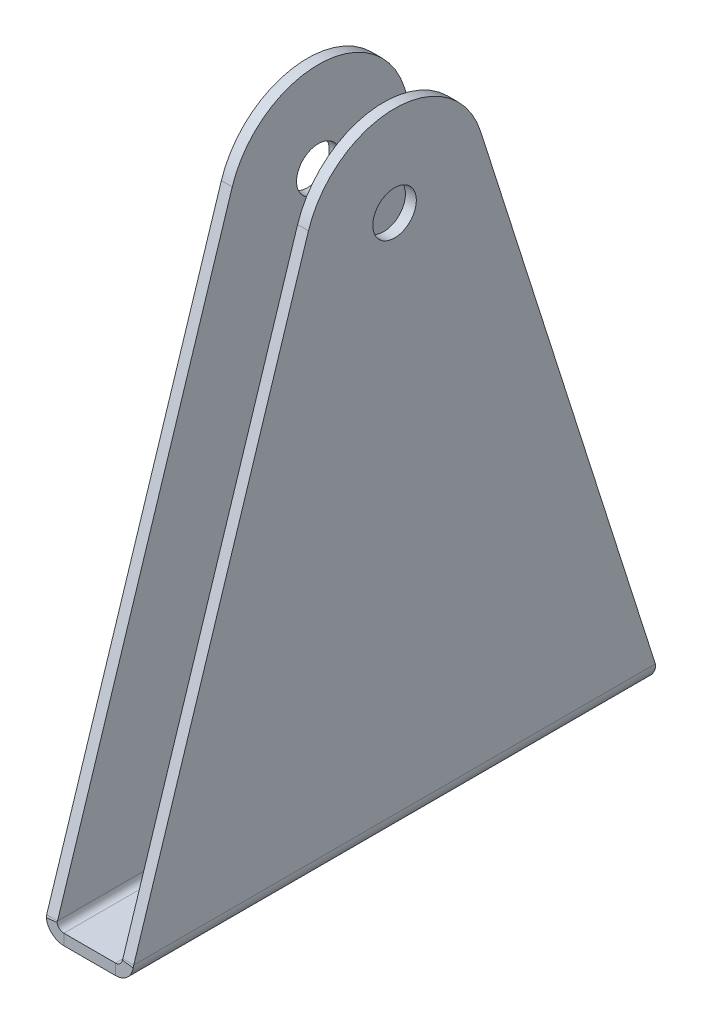
ISO-10303-21;
HEADER;
FILE_DESCRIPTION(('STEP AP214'),'2;1');
FILE_NAME('part.step','',(''),(''),'','','');
FILE_SCHEMA(('AUTOMOTIVE_DESIGN { 1 0 10303 214 1 1 1 1 }'));
ENDSEC;
DATA;
#1=APPLICATION_CONTEXT('core data for automotive mechanical design processes');
#2=APPLICATION_PROTOCOL_DEFINITION('international standard','automotive_design',2000,#1);
#3=PRODUCT_CONTEXT('',#1,'mechanical');
#4=PRODUCT('Part','Part','',(#3));
#5=PRODUCT_RELATED_PRODUCT_CATEGORY('part','',(#4));
#6=PRODUCT_DEFINITION_FORMATION('','',#4);
#7=PRODUCT_DEFINITION_CONTEXT('part definition',#1,'design');
#8=PRODUCT_DEFINITION('design','',#6,#7);
#9=PRODUCT_DEFINITION_SHAPE('','',#8);
#10=(LENGTH_UNIT() NAMED_UNIT(*) SI_UNIT(.MILLI.,.METRE.));
#11=(NAMED_UNIT(*) PLANE_ANGLE_UNIT() SI_UNIT($,.RADIAN.));
#12=(NAMED_UNIT(*) SI_UNIT($,.STERADIAN.) SOLID_ANGLE_UNIT());
#13=UNCERTAINTY_MEASURE_WITH_UNIT(LENGTH_MEASURE(1.E-05),#10,'distance_accuracy_value','');
#14=(GEOMETRIC_REPRESENTATION_CONTEXT(3) GLOBAL_UNCERTAINTY_ASSIGNED_CONTEXT((#13)) GLOBAL_UNIT_ASSIGNED_CONTEXT((#10,
#11,#12)) REPRESENTATION_CONTEXT('',''));
#15=CARTESIAN_POINT('',(0.,0.,0.));
#16=DIRECTION('',(0.,0.,1.));
#17=DIRECTION('',(1.,0.,0.));
#18=AXIS2_PLACEMENT_3D('',#15,#16,#17);
#19=CARTESIAN_POINT('',(-165.1,0.,0.));
#20=DIRECTION('',(0.,-1.,0.));
#21=DIRECTION('',(0.,0.,-1.));
#22=AXIS2_PLACEMENT_3D('',#19,#20,#21);
#23=PLANE('',#22);
#24=DIRECTION('',(-1.,0.,0.));
#25=VECTOR('',#24,1.);
#26=CARTESIAN_POINT('',(-12.7,0.,-76.2));
#27=LINE('',#26,#25);
#28=CARTESIAN_POINT('',(7.525,0.,-76.2));
#29=VERTEX_POINT('',#28);
#30=CARTESIAN_POINT('',(-7.52500000000002,0.,-76.2));
#31=VERTEX_POINT('',#30);
#32=EDGE_CURVE('E93',#29,#31,#27,.T.);
#33=ORIENTED_EDGE('',*,*,#32,.T.);
#34=DIRECTION('',(0.,0.,1.));
#35=VECTOR('',#34,1.);
#36=CARTESIAN_POINT('',(-7.525,0.,0.));
#37=LINE('',#36,#35);
#38=CARTESIAN_POINT('',(-7.52500000000002,0.,76.2));
#39=VERTEX_POINT('',#38);
#40=EDGE_CURVE('E85',#31,#39,#37,.T.);
#41=ORIENTED_EDGE('',*,*,#40,.T.);
#42=DIRECTION('',(1.,0.,0.));
#43=VECTOR('',#42,1.);
#44=CARTESIAN_POINT('',(-12.7,0.,76.2));
#45=LINE('',#44,#43);
#46=CARTESIAN_POINT('',(7.525,0.,76.2));
#47=VERTEX_POINT('',#46);
#48=EDGE_CURVE('E101',#39,#47,#45,.T.);
#49=ORIENTED_EDGE('',*,*,#48,.T.);
#50=DIRECTION('',(0.,0.,-1.));
#51=VECTOR('',#50,1.);
#52=CARTESIAN_POINT('',(7.525,0.,0.));
#53=LINE('',#52,#51);
#54=EDGE_CURVE('E493',#47,#29,#53,.T.);
#55=ORIENTED_EDGE('',*,*,#54,.T.);
#56=EDGE_LOOP('',(#33,#41,#49,#55));
#57=FACE_BOUND('',#56,.T.);
#58=ADVANCED_FACE('F75',(#57),#23,.F.);
#59=CARTESIAN_POINT('',(-12.7,-3.175,-76.2));
#60=DIRECTION('',(0.,0.,-1.));
#61=DIRECTION('',(-1.,0.,0.));
#62=AXIS2_PLACEMENT_3D('',#59,#60,#61);
#63=PLANE('',#62);
#64=DIRECTION('',(0.,-1.,0.));
#65=VECTOR('',#64,1.);
#66=CARTESIAN_POINT('',(-7.52500000000002,-3.175,-76.2));
#67=LINE('',#66,#65);
#68=CARTESIAN_POINT('',(-7.525,-3.175,-76.2));
#69=VERTEX_POINT('',#68);
#70=EDGE_CURVE('E12',#31,#69,#67,.T.);
#71=ORIENTED_EDGE('',*,*,#70,.F.);
#72=ORIENTED_EDGE('',*,*,#32,.F.);
#73=DIRECTION('',(0.,1.,0.));
#74=VECTOR('',#73,1.);
#75=CARTESIAN_POINT('',(7.52500000000002,-3.175,-76.2));
#76=LINE('',#75,#74);
#77=CARTESIAN_POINT('',(7.525,-3.175,-76.2));
#78=VERTEX_POINT('',#77);
#79=EDGE_CURVE('E701',#78,#29,#76,.T.);
#80=ORIENTED_EDGE('',*,*,#79,.F.);
#81=DIRECTION('',(-1.,0.,0.));
#82=VECTOR('',#81,1.);
#83=CARTESIAN_POINT('',(-12.7,-3.175,-76.2));
#84=LINE('',#83,#82);
#85=EDGE_CURVE('E418',#78,#69,#84,.T.);
#86=ORIENTED_EDGE('',*,*,#85,.T.);
#87=EDGE_LOOP('',(#71,#72,#80,#86));
#88=FACE_BOUND('',#87,.T.);
#89=ADVANCED_FACE('F416',(#88),#63,.T.);
#90=CARTESIAN_POINT('',(-12.7,-3.175,76.2));
#91=DIRECTION('',(0.,0.,1.));
#92=DIRECTION('',(1.,0.,0.));
#93=AXIS2_PLACEMENT_3D('',#90,#91,#92);
#94=PLANE('',#93);
#95=DIRECTION('',(0.,1.,0.));
#96=VECTOR('',#95,1.);
#97=CARTESIAN_POINT('',(-7.52500000000002,-3.175,76.2));
#98=LINE('',#97,#96);
#99=CARTESIAN_POINT('',(-7.525,-3.175,76.2));
#100=VERTEX_POINT('',#99);
#101=EDGE_CURVE('E421',#100,#39,#98,.T.);
#102=ORIENTED_EDGE('',*,*,#101,.F.);
#103=DIRECTION('',(1.,0.,0.));
#104=VECTOR('',#103,1.);
#105=CARTESIAN_POINT('',(-12.7,-3.175,76.2));
#106=LINE('',#105,#104);
#107=CARTESIAN_POINT('',(7.525,-3.175,76.2));
#108=VERTEX_POINT('',#107);
#109=EDGE_CURVE('E429',#100,#108,#106,.T.);
#110=ORIENTED_EDGE('',*,*,#109,.T.);
#111=DIRECTION('',(0.,-1.,0.));
#112=VECTOR('',#111,1.);
#113=CARTESIAN_POINT('',(7.52500000000002,-3.175,76.2));
#114=LINE('',#113,#112);
#115=EDGE_CURVE('E491',#47,#108,#114,.T.);
#116=ORIENTED_EDGE('',*,*,#115,.F.);
#117=ORIENTED_EDGE('',*,*,#48,.F.);
#118=EDGE_LOOP('',(#102,#110,#116,#117));
#119=FACE_BOUND('',#118,.T.);
#120=ADVANCED_FACE('F474',(#119),#94,.T.);
#121=CARTESIAN_POINT('',(-165.1,-3.175,0.));
#122=DIRECTION('',(0.,-1.,0.));
#123=DIRECTION('',(0.,0.,-1.));
#124=AXIS2_PLACEMENT_3D('',#121,#122,#123);
#125=PLANE('',#124);
#126=DIRECTION('',(0.,0.,1.));
#127=VECTOR('',#126,1.);
#128=CARTESIAN_POINT('',(-7.525,-3.175,0.));
#129=LINE('',#128,#127);
#130=EDGE_CURVE('E423',#69,#100,#129,.T.);
#131=ORIENTED_EDGE('',*,*,#130,.F.);
#132=ORIENTED_EDGE('',*,*,#85,.F.);
#133=DIRECTION('',(0.,0.,-1.));
#134=VECTOR('',#133,1.);
#135=CARTESIAN_POINT('',(7.525,-3.175,0.));
#136=LINE('',#135,#134);
#137=EDGE_CURVE('E428',#108,#78,#136,.T.);
#138=ORIENTED_EDGE('',*,*,#137,.F.);
#139=ORIENTED_EDGE('',*,*,#109,.F.);
#140=EDGE_LOOP('',(#131,#132,#138,#139));
#141=FACE_BOUND('',#140,.T.);
#142=ADVANCED_FACE('F479',(#141),#125,.T.);
#143=CARTESIAN_POINT('',(12.7,2.,76.0533978713816));
#144=CARTESIAN_POINT('',(12.7,1.7787021485687,76.1022656260443));
#145=CARTESIAN_POINT('',(12.6857860065297,1.55741042278952,76.1511322453373));
#146=CARTESIAN_POINT('',(12.6574740404794,1.33793110343009,76.2));
#147=CARTESIAN_POINT('',(9.525,2.,76.0533978713816));
#148=CARTESIAN_POINT('',(9.525,1.91447439644371,76.1022655482638));
#149=CARTESIAN_POINT('',(9.51950665177464,1.82895075302594,76.1511323231178));
#150=CARTESIAN_POINT('',(9.50856484656208,1.7441279626783,76.2));
#151=B_SPLINE_SURFACE_WITH_KNOTS('',1,3,((#143,#144,#145,#146),(#147,#148,#149,#150)),
.UNSPECIFIED.,.F.,.F.,.F.,(2,2),(4,4),(0.,1.),(0.,1.),.UNSPECIFIED.);
#152=CARTESIAN_POINT('',(12.7,2.,76.0533978713816));
#153=CARTESIAN_POINT('',(9.525,2.,76.0533978713816));
#154=B_SPLINE_CURVE_WITH_KNOTS('',1,(#152,#153),.UNSPECIFIED.,.F.,.F.,(2,2),(0.,1.),.UNSPECIFIED.);
#155=CARTESIAN_POINT('',(9.52500000000002,2.,76.0533978713816));
#156=VERTEX_POINT('',#155);
#157=CARTESIAN_POINT('',(12.7,2.00000000000004,76.0533978713816));
#158=VERTEX_POINT('',#157);
#159=EDGE_CURVE('E649',#156,#158,#154,.F.);
#160=CARTESIAN_POINT('',(9.525,2.,76.0533978713816));
#161=CARTESIAN_POINT('',(9.525,1.91447439644371,76.1022655482638));
#162=CARTESIAN_POINT('',(9.51950665177464,1.82895075302594,76.1511323231178));
#163=CARTESIAN_POINT('',(9.50856484656208,1.7441279626783,76.2));
#164=B_SPLINE_CURVE_WITH_KNOTS('',3,(#160,#161,#162,#163),.UNSPECIFIED.,.F.,.F.,(4,4),(0.,1.),.UNSPECIFIED.);
#165=CARTESIAN_POINT('',(9.50856484656208,1.7441279626783,76.2));
#166=VERTEX_POINT('',#165);
#167=EDGE_CURVE('E658',#156,#166,#164,.T.);
#168=CARTESIAN_POINT('',(9.50856484656208,1.7441279626783,76.2));
#169=CARTESIAN_POINT('',(12.6574740404794,1.33793110343009,76.2));
#170=B_SPLINE_CURVE_WITH_KNOTS('',1,(#168,#169),.UNSPECIFIED.,.F.,.F.,(2,2),(0.,1.),.UNSPECIFIED.);
#171=CARTESIAN_POINT('',(12.6574740404794,1.33793110343009,76.2));
#172=VERTEX_POINT('',#171);
#173=EDGE_CURVE('E433',#166,#172,#170,.T.);
#174=CARTESIAN_POINT('',(12.6574740404794,1.33793110343009,76.2));
#175=CARTESIAN_POINT('',(12.6857860065297,1.55741042278952,76.1511322453373));
#176=CARTESIAN_POINT('',(12.7,1.7787021485687,76.1022656260443));
#177=CARTESIAN_POINT('',(12.7,2.,76.0533978713816));
#178=B_SPLINE_CURVE_WITH_KNOTS('',3,(#174,#175,#176,#177),.UNSPECIFIED.,.F.,.F.,(4,4),(0.,1.),.UNSPECIFIED.);
#179=EDGE_CURVE('E660',#158,#172,#178,.F.);
#180=ORIENTED_EDGE('',*,*,#159,.F.);
#181=ORIENTED_EDGE('',*,*,#167,.T.);
#182=ORIENTED_EDGE('',*,*,#173,.T.);
#183=ORIENTED_EDGE('',*,*,#179,.F.);
#184=EDGE_LOOP('',(#180,#181,#182,#183));
#185=FACE_BOUND('',#184,.T.);
#186=ADVANCED_FACE('F483',(#185),#151,.T.);
#187=CARTESIAN_POINT('',(7.525,2.,76.2));
#188=DIRECTION('',(0.,0.,1.));
#189=DIRECTION('',(1.,0.,0.));
#190=AXIS2_PLACEMENT_3D('',#187,#188,#189);
#191=PLANE('',#190);
#192=ORIENTED_EDGE('',*,*,#173,.F.);
#193=CARTESIAN_POINT('',(7.525,2.,76.2));
#194=DIRECTION('',(0.,0.,1.));
#195=DIRECTION('',(1.,0.,0.));
#196=AXIS2_PLACEMENT_3D('',#193,#194,#195);
#197=CIRCLE('',#196,2.);
#198=EDGE_CURVE('E571',#166,#47,#197,.F.);
#199=ORIENTED_EDGE('',*,*,#198,.T.);
#200=ORIENTED_EDGE('',*,*,#115,.T.);
#201=CARTESIAN_POINT('',(7.525,2.,76.2));
#202=DIRECTION('',(0.,0.,-1.));
#203=DIRECTION('',(1.,0.,0.));
#204=AXIS2_PLACEMENT_3D('',#201,#202,#203);
#205=CIRCLE('',#204,5.175);
#206=EDGE_CURVE('E550',#172,#108,#205,.T.);
#207=ORIENTED_EDGE('',*,*,#206,.F.);
#208=EDGE_LOOP('',(#192,#199,#200,#207));
#209=FACE_BOUND('',#208,.T.);
#210=ADVANCED_FACE('F488',(#209),#191,.T.);
#211=CARTESIAN_POINT('',(7.525,2.,-76.2));
#212=DIRECTION('',(0.,0.,-1.));
#213=DIRECTION('',(-1.,0.,0.));
#214=AXIS2_PLACEMENT_3D('',#211,#212,#213);
#215=PLANE('',#214);
#216=ORIENTED_EDGE('',*,*,#79,.T.);
#217=CARTESIAN_POINT('',(7.525,2.,-76.1999999999999));
#218=DIRECTION('',(0.,0.,1.));
#219=DIRECTION('',(1.,0.,0.));
#220=AXIS2_PLACEMENT_3D('',#217,#218,#219);
#221=CIRCLE('',#220,2.);
#222=CARTESIAN_POINT('',(9.50856484656208,1.7441279626783,-76.2));
#223=VERTEX_POINT('',#222);
#224=EDGE_CURVE('E563',#29,#223,#221,.T.);
#225=ORIENTED_EDGE('',*,*,#224,.T.);
#226=CARTESIAN_POINT('',(12.6574740404794,1.33793110343009,-76.2));
#227=CARTESIAN_POINT('',(9.50856484656208,1.7441279626783,-76.2));
#228=B_SPLINE_CURVE_WITH_KNOTS('',1,(#226,#227),.UNSPECIFIED.,.F.,.F.,(2,2),(0.,1.),.UNSPECIFIED.);
#229=CARTESIAN_POINT('',(12.6574740404794,1.3379311034301,-76.2));
#230=VERTEX_POINT('',#229);
#231=EDGE_CURVE('E621',#223,#230,#228,.F.);
#232=ORIENTED_EDGE('',*,*,#231,.T.);
#233=CARTESIAN_POINT('',(7.525,2.,-76.2));
#234=DIRECTION('',(0.,0.,1.));
#235=DIRECTION('',(-1.,0.,0.));
#236=AXIS2_PLACEMENT_3D('',#233,#234,#235);
#237=CIRCLE('',#236,5.175);
#238=EDGE_CURVE('E548',#78,#230,#237,.T.);
#239=ORIENTED_EDGE('',*,*,#238,.F.);
#240=EDGE_LOOP('',(#216,#225,#232,#239));
#241=FACE_BOUND('',#240,.T.);
#242=ADVANCED_FACE('F590',(#241),#215,.T.);
#243=CARTESIAN_POINT('',(12.6574740404794,1.33793110343009,-76.2));
#244=CARTESIAN_POINT('',(12.6857860065297,1.55741042278954,-76.1511322453372));
#245=CARTESIAN_POINT('',(12.7,1.77870214856868,-76.1022656260443));
#246=CARTESIAN_POINT('',(12.7,2.,-76.0533978713815));
#247=CARTESIAN_POINT('',(9.50856484656208,1.7441279626783,-76.2));
#248=CARTESIAN_POINT('',(9.51950665177464,1.82895075302592,-76.1511323231177));
#249=CARTESIAN_POINT('',(9.525,1.91447439644372,-76.1022655482638));
#250=CARTESIAN_POINT('',(9.525,2.,-76.0533978713815));
#251=B_SPLINE_SURFACE_WITH_KNOTS('',1,3,((#243,#244,#245,#246),(#247,#248,#249,#250)),
.UNSPECIFIED.,.F.,.F.,.F.,(2,2),(4,4),(0.,1.),(0.,1.),.UNSPECIFIED.);
#252=CARTESIAN_POINT('',(9.50856484656208,1.7441279626783,-76.2));
#253=CARTESIAN_POINT('',(9.51950665177464,1.82895075302592,-76.1511323231177));
#254=CARTESIAN_POINT('',(9.525,1.91447439644372,-76.1022655482638));
#255=CARTESIAN_POINT('',(9.525,2.,-76.0533978713815));
#256=B_SPLINE_CURVE_WITH_KNOTS('',3,(#252,#253,#254,#255),.UNSPECIFIED.,.F.,.F.,(4,4),(0.,1.),.UNSPECIFIED.);
#257=CARTESIAN_POINT('',(9.52500000000002,2.,-76.0533978713815));
#258=VERTEX_POINT('',#257);
#259=EDGE_CURVE('E559',#223,#258,#256,.T.);
#260=CARTESIAN_POINT('',(9.525,2.,-76.0533978713815));
#261=CARTESIAN_POINT('',(12.7,2.,-76.0533978713815));
#262=B_SPLINE_CURVE_WITH_KNOTS('',1,(#260,#261),.UNSPECIFIED.,.F.,.F.,(2,2),(0.,1.),.UNSPECIFIED.);
#263=CARTESIAN_POINT('',(12.7,2.00000000000002,-76.0533978713815));
#264=VERTEX_POINT('',#263);
#265=EDGE_CURVE('E699',#264,#258,#262,.F.);
#266=CARTESIAN_POINT('',(12.7,2.,-76.0533978713815));
#267=CARTESIAN_POINT('',(12.7,1.77870214856868,-76.1022656260443));
#268=CARTESIAN_POINT('',(12.6857860065297,1.55741042278954,-76.1511322453372));
#269=CARTESIAN_POINT('',(12.6574740404794,1.33793110343009,-76.2));
#270=B_SPLINE_CURVE_WITH_KNOTS('',3,(#266,#267,#268,#269),.UNSPECIFIED.,.F.,.F.,(4,4),(0.,1.),.UNSPECIFIED.);
#271=EDGE_CURVE('E547',#230,#264,#270,.F.);
#272=ORIENTED_EDGE('',*,*,#259,.T.);
#273=ORIENTED_EDGE('',*,*,#265,.F.);
#274=ORIENTED_EDGE('',*,*,#271,.F.);
#275=ORIENTED_EDGE('',*,*,#231,.F.);
#276=EDGE_LOOP('',(#272,#273,#274,#275));
#277=FACE_BOUND('',#276,.T.);
#278=ADVANCED_FACE('F519',(#277),#251,.T.);
#279=CARTESIAN_POINT('',(7.525,2.,-152.537196980579));
#280=DIRECTION('',(0.,0.,1.));
#281=DIRECTION('',(1.,0.,0.));
#282=AXIS2_PLACEMENT_3D('',#279,#280,#281);
#283=CYLINDRICAL_SURFACE('',#282,5.175);
#284=ORIENTED_EDGE('',*,*,#238,.T.);
#285=ORIENTED_EDGE('',*,*,#271,.T.);
#286=DIRECTION('',(0.,0.,-1.));
#287=VECTOR('',#286,1.);
#288=CARTESIAN_POINT('',(12.7,2.00000000000001,0.));
#289=LINE('',#288,#287);
#290=EDGE_CURVE('E717',#158,#264,#289,.T.);
#291=ORIENTED_EDGE('',*,*,#290,.F.);
#292=ORIENTED_EDGE('',*,*,#179,.T.);
#293=ORIENTED_EDGE('',*,*,#206,.T.);
#294=ORIENTED_EDGE('',*,*,#137,.T.);
#295=EDGE_LOOP('',(#284,#285,#291,#292,#293,#294));
#296=FACE_BOUND('',#295,.T.);
#297=ADVANCED_FACE('F514',(#296),#283,.T.);
#298=CARTESIAN_POINT('',(7.525,2.,-152.537196980579));
#299=DIRECTION('',(0.,0.,1.));
#300=DIRECTION('',(1.,0.,0.));
#301=AXIS2_PLACEMENT_3D('',#298,#299,#300);
#302=CYLINDRICAL_SURFACE('',#301,2.);
#303=ORIENTED_EDGE('',*,*,#224,.F.);
#304=ORIENTED_EDGE('',*,*,#54,.F.);
#305=ORIENTED_EDGE('',*,*,#198,.F.);
#306=ORIENTED_EDGE('',*,*,#167,.F.);
#307=DIRECTION('',(0.,0.,-1.));
#308=VECTOR('',#307,1.);
#309=CARTESIAN_POINT('',(9.52500000000002,2.,0.));
#310=LINE('',#309,#308);
#311=EDGE_CURVE('E668',#156,#258,#310,.T.);
#312=ORIENTED_EDGE('',*,*,#311,.T.);
#313=ORIENTED_EDGE('',*,*,#259,.F.);
#314=EDGE_LOOP('',(#303,#304,#305,#306,#312,#313));
#315=FACE_BOUND('',#314,.T.);
#316=ADVANCED_FACE('F518',(#315),#302,.F.);
#317=CARTESIAN_POINT('',(12.6999999999995,153.939768177623,0.));
#318=DIRECTION('',(-1.,0.,0.));
#319=DIRECTION('',(0.,0.,1.));
#320=AXIS2_PLACEMENT_3D('',#317,#318,#319);
#321=CYLINDRICAL_SURFACE('',#320,26.35);
#322=CARTESIAN_POINT('',(9.52499999999949,153.939768177623,0.));
#323=DIRECTION('',(-1.,0.,0.));
#324=DIRECTION('',(0.,0.,1.));
#325=AXIS2_PLACEMENT_3D('',#322,#323,#324);
#326=CIRCLE('',#325,26.35);
#327=CARTESIAN_POINT('',(9.52499999999946,161.937344507584,25.1069964919432));
#328=VERTEX_POINT('',#327);
#329=CARTESIAN_POINT('',(9.52499999999946,161.937344507584,-25.1069964919432));
#330=VERTEX_POINT('',#329);
#331=EDGE_CURVE('E718',#328,#330,#326,.T.);
#332=ORIENTED_EDGE('',*,*,#331,.F.);
#333=DIRECTION('',(-1.,0.,0.));
#334=VECTOR('',#333,1.);
#335=CARTESIAN_POINT('',(12.6999999999995,161.937344507584,25.1069964919432));
#336=LINE('',#335,#334);
#337=CARTESIAN_POINT('',(12.6999999999995,161.937344507584,25.1069964919432));
#338=VERTEX_POINT('',#337);
#339=EDGE_CURVE('E671',#338,#328,#336,.T.);
#340=ORIENTED_EDGE('',*,*,#339,.F.);
#341=CARTESIAN_POINT('',(12.6999999999995,153.939768177623,0.));
#342=DIRECTION('',(-1.,0.,0.));
#343=DIRECTION('',(0.,0.,1.));
#344=AXIS2_PLACEMENT_3D('',#341,#342,#343);
#345=CIRCLE('',#344,26.35);
#346=CARTESIAN_POINT('',(12.6999999999995,161.937344507584,-25.1069964919432));
#347=VERTEX_POINT('',#346);
#348=EDGE_CURVE('E705',#338,#347,#345,.T.);
#349=ORIENTED_EDGE('',*,*,#348,.T.);
#350=DIRECTION('',(-1.,0.,0.));
#351=VECTOR('',#350,1.);
#352=CARTESIAN_POINT('',(12.6999999999995,161.937344507584,-25.1069964919432));
#353=LINE('',#352,#351);
#354=EDGE_CURVE('E709',#347,#330,#353,.T.);
#355=ORIENTED_EDGE('',*,*,#354,.T.);
#356=EDGE_LOOP('',(#332,#340,#349,#355));
#357=FACE_BOUND('',#356,.T.);
#358=ADVANCED_FACE('F319',(#357),#321,.T.);
#359=CARTESIAN_POINT('',(12.6999999999995,153.939768177623,0.));
#360=DIRECTION('',(-1.,0.,0.));
#361=DIRECTION('',(0.,0.,1.));
#362=AXIS2_PLACEMENT_3D('',#359,#360,#361);
#363=CYLINDRICAL_SURFACE('',#362,6.35);
#364=CARTESIAN_POINT('',(12.6999999999995,153.939768177623,0.));
#365=DIRECTION('',(-1.,0.,0.));
#366=DIRECTION('',(0.,0.,1.));
#367=AXIS2_PLACEMENT_3D('',#364,#365,#366);
#368=CIRCLE('',#367,6.35);
#369=CARTESIAN_POINT('',(12.6999999999995,153.939768177623,6.35));
#370=VERTEX_POINT('',#369);
#371=EDGE_CURVE('E714',#370,#370,#368,.T.);
#372=ORIENTED_EDGE('',*,*,#371,.F.);
#373=EDGE_LOOP('',(#372));
#374=FACE_BOUND('',#373,.T.);
#375=CARTESIAN_POINT('',(9.52499999999949,153.939768177623,0.));
#376=DIRECTION('',(-1.,0.,0.));
#377=DIRECTION('',(0.,0.,1.));
#378=AXIS2_PLACEMENT_3D('',#375,#376,#377);
#379=CIRCLE('',#378,6.35);
#380=CARTESIAN_POINT('',(9.52499999999949,153.939768177623,6.35));
#381=VERTEX_POINT('',#380);
#382=EDGE_CURVE('E711',#381,#381,#379,.T.);
#383=ORIENTED_EDGE('',*,*,#382,.T.);
#384=EDGE_LOOP('',(#383));
#385=FACE_BOUND('',#384,.T.);
#386=ADVANCED_FACE('F762',(#374,#385),#363,.F.);
#387=CARTESIAN_POINT('',(12.7000000000006,-176.260231822377,0.));
#388=DIRECTION('',(1.,0.,0.));
#389=DIRECTION('',(0.,0.,-1.));
#390=AXIS2_PLACEMENT_3D('',#387,#388,#389);
#391=PLANE('',#390);
#392=ORIENTED_EDGE('',*,*,#371,.T.);
#393=EDGE_LOOP('',(#392));
#394=FACE_BOUND('',#393,.T.);
#395=DIRECTION('',(0.,0.952827191345092,-0.303513333205354));
#396=VECTOR('',#395,1.);
#397=CARTESIAN_POINT('',(12.7,1.53976817762329,76.2));
#398=LINE('',#397,#396);
#399=EDGE_CURVE('E663',#158,#338,#398,.T.);
#400=ORIENTED_EDGE('',*,*,#399,.F.);
#401=ORIENTED_EDGE('',*,*,#290,.T.);
#402=DIRECTION('',(0.,-0.952827191345092,-0.303513333205354));
#403=VECTOR('',#402,1.);
#404=CARTESIAN_POINT('',(12.7,1.53976817762329,-76.2));
#405=LINE('',#404,#403);
#406=EDGE_CURVE('E737',#347,#264,#405,.T.);
#407=ORIENTED_EDGE('',*,*,#406,.F.);
#408=ORIENTED_EDGE('',*,*,#348,.F.);
#409=EDGE_LOOP('',(#400,#401,#407,#408));
#410=FACE_BOUND('',#409,.T.);
#411=ADVANCED_FACE('F760',(#394,#410),#391,.T.);
#412=CARTESIAN_POINT('',(12.7,1.53976817762329,-76.2));
#413=DIRECTION('',(0.,0.303513333205354,-0.952827191345092));
#414=DIRECTION('',(0.,-0.952827191345092,-0.303513333205354));
#415=AXIS2_PLACEMENT_3D('',#412,#413,#414);
#416=PLANE('',#415);
#417=ORIENTED_EDGE('',*,*,#406,.T.);
#418=ORIENTED_EDGE('',*,*,#265,.T.);
#419=DIRECTION('',(0.,-0.952827191345092,-0.303513333205354));
#420=VECTOR('',#419,1.);
#421=CARTESIAN_POINT('',(9.52500000000002,1.53976817762328,-76.2));
#422=LINE('',#421,#420);
#423=EDGE_CURVE('E664',#330,#258,#422,.T.);
#424=ORIENTED_EDGE('',*,*,#423,.F.);
#425=ORIENTED_EDGE('',*,*,#354,.F.);
#426=EDGE_LOOP('',(#417,#418,#424,#425));
#427=FACE_BOUND('',#426,.T.);
#428=ADVANCED_FACE('F751',(#427),#416,.T.);
#429=CARTESIAN_POINT('',(9.52500000000064,-176.260231822377,0.));
#430=DIRECTION('',(1.,0.,0.));
#431=DIRECTION('',(0.,0.,-1.));
#432=AXIS2_PLACEMENT_3D('',#429,#430,#431);
#433=PLANE('',#432);
#434=ORIENTED_EDGE('',*,*,#311,.F.);
#435=DIRECTION('',(0.,0.952827191345092,-0.303513333205354));
#436=VECTOR('',#435,1.);
#437=CARTESIAN_POINT('',(9.52500000000002,1.53976817762328,76.2));
#438=LINE('',#437,#436);
#439=EDGE_CURVE('E721',#156,#328,#438,.T.);
#440=ORIENTED_EDGE('',*,*,#439,.T.);
#441=ORIENTED_EDGE('',*,*,#331,.T.);
#442=ORIENTED_EDGE('',*,*,#423,.T.);
#443=EDGE_LOOP('',(#434,#440,#441,#442));
#444=FACE_BOUND('',#443,.T.);
#445=ORIENTED_EDGE('',*,*,#382,.F.);
#446=EDGE_LOOP('',(#445));
#447=FACE_BOUND('',#446,.T.);
#448=ADVANCED_FACE('F511',(#444,#447),#433,.F.);
#449=CARTESIAN_POINT('',(12.7,1.53976817762329,76.2));
#450=DIRECTION('',(0.,0.303513333205354,0.952827191345091));
#451=DIRECTION('',(0.,0.952827191345092,-0.303513333205354));
#452=AXIS2_PLACEMENT_3D('',#449,#450,#451);
#453=PLANE('',#452);
#454=ORIENTED_EDGE('',*,*,#439,.F.);
#455=ORIENTED_EDGE('',*,*,#159,.T.);
#456=ORIENTED_EDGE('',*,*,#399,.T.);
#457=ORIENTED_EDGE('',*,*,#339,.T.);
#458=EDGE_LOOP('',(#454,#455,#456,#457));
#459=FACE_BOUND('',#458,.T.);
#460=ADVANCED_FACE('F501',(#459),#453,.T.);
#461=CARTESIAN_POINT('',(-12.7,2.,-76.0533978713815));
#462=CARTESIAN_POINT('',(-12.7,1.77870214856868,-76.1022656260443));
#463=CARTESIAN_POINT('',(-12.6857860065297,1.55741042278954,-76.1511322453372));
#464=CARTESIAN_POINT('',(-12.6574740404794,1.33793110343009,-76.2));
#465=CARTESIAN_POINT('',(-9.525,2.,-76.0533978713815));
#466=CARTESIAN_POINT('',(-9.525,1.91447439644369,-76.1022655482638));
#467=CARTESIAN_POINT('',(-9.51950665177464,1.82895075302595,-76.1511323231177));
#468=CARTESIAN_POINT('',(-9.50856484656208,1.7441279626783,-76.2));
#469=B_SPLINE_SURFACE_WITH_KNOTS('',1,3,((#461,#462,#463,#464),(#465,#466,#467,#468)),
.UNSPECIFIED.,.F.,.F.,.F.,(2,2),(4,4),(0.,1.),(0.,1.),.UNSPECIFIED.);
#470=CARTESIAN_POINT('',(-12.7,2.,-76.0533978713815));
#471=CARTESIAN_POINT('',(-9.525,2.,-76.0533978713815));
#472=B_SPLINE_CURVE_WITH_KNOTS('',1,(#470,#471),.UNSPECIFIED.,.F.,.F.,(2,2),(0.,1.),.UNSPECIFIED.);
#473=CARTESIAN_POINT('',(-9.52500000000002,2.00000000000001,-76.0533978713815));
#474=VERTEX_POINT('',#473);
#475=CARTESIAN_POINT('',(-12.7,2.00000000000004,-76.0533978713815));
#476=VERTEX_POINT('',#475);
#477=EDGE_CURVE('E198',#474,#476,#472,.F.);
#478=CARTESIAN_POINT('',(-9.525,2.,-76.0533978713815));
#479=CARTESIAN_POINT('',(-9.525,1.91447439644369,-76.1022655482638));
#480=CARTESIAN_POINT('',(-9.51950665177464,1.82895075302595,-76.1511323231177));
#481=CARTESIAN_POINT('',(-9.50856484656208,1.7441279626783,-76.2));
#482=B_SPLINE_CURVE_WITH_KNOTS('',3,(#478,#479,#480,#481),.UNSPECIFIED.,.F.,.F.,(4,4),(0.,1.),.UNSPECIFIED.);
#483=CARTESIAN_POINT('',(-9.50856484656208,1.7441279626783,-76.2));
#484=VERTEX_POINT('',#483);
#485=EDGE_CURVE('E209',#474,#484,#482,.T.);
#486=CARTESIAN_POINT('',(-9.50856484656208,1.7441279626783,-76.2));
#487=CARTESIAN_POINT('',(-12.6574740404794,1.33793110343009,-76.2));
#488=B_SPLINE_CURVE_WITH_KNOTS('',1,(#486,#487),.UNSPECIFIED.,.F.,.F.,(2,2),(0.,1.),.UNSPECIFIED.);
#489=CARTESIAN_POINT('',(-12.6574740404794,1.33793110343009,-76.2));
#490=VERTEX_POINT('',#489);
#491=EDGE_CURVE('E414',#484,#490,#488,.T.);
#492=CARTESIAN_POINT('',(-12.6574740404794,1.33793110343009,-76.2));
#493=CARTESIAN_POINT('',(-12.6857860065297,1.55741042278954,-76.1511322453372));
#494=CARTESIAN_POINT('',(-12.7,1.77870214856868,-76.1022656260443));
#495=CARTESIAN_POINT('',(-12.7,2.,-76.0533978713815));
#496=B_SPLINE_CURVE_WITH_KNOTS('',3,(#492,#493,#494,#495),.UNSPECIFIED.,.F.,.F.,(4,4),(0.,1.),.UNSPECIFIED.);
#497=EDGE_CURVE('E385',#476,#490,#496,.F.);
#498=ORIENTED_EDGE('',*,*,#477,.F.);
#499=ORIENTED_EDGE('',*,*,#485,.T.);
#500=ORIENTED_EDGE('',*,*,#491,.T.);
#501=ORIENTED_EDGE('',*,*,#497,.F.);
#502=EDGE_LOOP('',(#498,#499,#500,#501));
#503=FACE_BOUND('',#502,.T.);
#504=ADVANCED_FACE('F314',(#503),#469,.T.);
#505=CARTESIAN_POINT('',(-7.525,2.,-76.2));
#506=DIRECTION('',(0.,0.,-1.));
#507=DIRECTION('',(-1.,0.,0.));
#508=AXIS2_PLACEMENT_3D('',#505,#506,#507);
#509=PLANE('',#508);
#510=ORIENTED_EDGE('',*,*,#491,.F.);
#511=CARTESIAN_POINT('',(-7.525,2.,-76.2));
#512=DIRECTION('',(0.,0.,-1.));
#513=DIRECTION('',(-1.,0.,0.));
#514=AXIS2_PLACEMENT_3D('',#511,#512,#513);
#515=CIRCLE('',#514,2.);
#516=EDGE_CURVE('E224',#484,#31,#515,.F.);
#517=ORIENTED_EDGE('',*,*,#516,.T.);
#518=ORIENTED_EDGE('',*,*,#70,.T.);
#519=CARTESIAN_POINT('',(-7.525,2.,-76.2));
#520=DIRECTION('',(0.,0.,1.));
#521=DIRECTION('',(-1.,0.,0.));
#522=AXIS2_PLACEMENT_3D('',#519,#520,#521);
#523=CIRCLE('',#522,5.175);
#524=EDGE_CURVE('E234',#490,#69,#523,.T.);
#525=ORIENTED_EDGE('',*,*,#524,.F.);
#526=EDGE_LOOP('',(#510,#517,#518,#525));
#527=FACE_BOUND('',#526,.T.);
#528=ADVANCED_FACE('F358',(#527),#509,.T.);
#529=CARTESIAN_POINT('',(-7.525,2.,76.2));
#530=DIRECTION('',(0.,0.,1.));
#531=DIRECTION('',(1.,0.,0.));
#532=AXIS2_PLACEMENT_3D('',#529,#530,#531);
#533=PLANE('',#532);
#534=ORIENTED_EDGE('',*,*,#101,.T.);
#535=CARTESIAN_POINT('',(-7.525,2.,76.2));
#536=DIRECTION('',(0.,0.,-1.));
#537=DIRECTION('',(-1.,0.,0.));
#538=AXIS2_PLACEMENT_3D('',#535,#536,#537);
#539=CIRCLE('',#538,2.);
#540=CARTESIAN_POINT('',(-9.50856484656208,1.7441279626783,76.2));
#541=VERTEX_POINT('',#540);
#542=EDGE_CURVE('E227',#39,#541,#539,.T.);
#543=ORIENTED_EDGE('',*,*,#542,.T.);
#544=CARTESIAN_POINT('',(-12.6574740404794,1.33793110343009,76.2));
#545=CARTESIAN_POINT('',(-9.50856484656208,1.7441279626783,76.2));
#546=B_SPLINE_CURVE_WITH_KNOTS('',1,(#544,#545),.UNSPECIFIED.,.F.,.F.,(2,2),(0.,1.),.UNSPECIFIED.);
#547=CARTESIAN_POINT('',(-12.6574740404794,1.3379311034301,76.2));
#548=VERTEX_POINT('',#547);
#549=EDGE_CURVE('E347',#541,#548,#546,.F.);
#550=ORIENTED_EDGE('',*,*,#549,.T.);
#551=CARTESIAN_POINT('',(-7.525,2.,76.2));
#552=DIRECTION('',(0.,0.,-1.));
#553=DIRECTION('',(1.,0.,0.));
#554=AXIS2_PLACEMENT_3D('',#551,#552,#553);
#555=CIRCLE('',#554,5.175);
#556=EDGE_CURVE('E273',#100,#548,#555,.T.);
#557=ORIENTED_EDGE('',*,*,#556,.F.);
#558=EDGE_LOOP('',(#534,#543,#550,#557));
#559=FACE_BOUND('',#558,.T.);
#560=ADVANCED_FACE('F313',(#559),#533,.T.);
#561=CARTESIAN_POINT('',(-12.6574740404794,1.33793110343009,76.2));
#562=CARTESIAN_POINT('',(-12.6857860065297,1.55741042278951,76.1511322453373));
#563=CARTESIAN_POINT('',(-12.7,1.7787021485687,76.1022656260443));
#564=CARTESIAN_POINT('',(-12.7,2.,76.0533978713815));
#565=CARTESIAN_POINT('',(-9.50856484656208,1.7441279626783,76.2));
#566=CARTESIAN_POINT('',(-9.51950665177465,1.82895075302597,76.1511323231177));
#567=CARTESIAN_POINT('',(-9.525,1.91447439644367,76.1022655482638));
#568=CARTESIAN_POINT('',(-9.525,2.,76.0533978713815));
#569=B_SPLINE_SURFACE_WITH_KNOTS('',1,3,((#561,#562,#563,#564),(#565,#566,#567,#568)),
.UNSPECIFIED.,.F.,.F.,.F.,(2,2),(4,4),(0.,1.),(0.,1.),.UNSPECIFIED.);
#570=CARTESIAN_POINT('',(-9.50856484656208,1.7441279626783,76.2));
#571=CARTESIAN_POINT('',(-9.51950665177465,1.82895075302597,76.1511323231177));
#572=CARTESIAN_POINT('',(-9.525,1.91447439644367,76.1022655482638));
#573=CARTESIAN_POINT('',(-9.525,2.,76.0533978713815));
#574=B_SPLINE_CURVE_WITH_KNOTS('',3,(#570,#571,#572,#573),.UNSPECIFIED.,.F.,.F.,(4,4),(0.,1.),.UNSPECIFIED.);
#575=CARTESIAN_POINT('',(-9.52500000000002,2.00000000000001,76.0533978713816));
#576=VERTEX_POINT('',#575);
#577=EDGE_CURVE('E282',#541,#576,#574,.T.);
#578=CARTESIAN_POINT('',(-9.525,2.,76.0533978713815));
#579=CARTESIAN_POINT('',(-12.7,2.,76.0533978713815));
#580=B_SPLINE_CURVE_WITH_KNOTS('',1,(#578,#579),.UNSPECIFIED.,.F.,.F.,(2,2),(0.,1.),.UNSPECIFIED.);
#581=CARTESIAN_POINT('',(-12.7,2.00000000000002,76.0533978713816));
#582=VERTEX_POINT('',#581);
#583=EDGE_CURVE('E442',#582,#576,#580,.F.);
#584=CARTESIAN_POINT('',(-12.7,2.,76.0533978713815));
#585=CARTESIAN_POINT('',(-12.7,1.7787021485687,76.1022656260443));
#586=CARTESIAN_POINT('',(-12.6857860065297,1.55741042278951,76.1511322453373));
#587=CARTESIAN_POINT('',(-12.6574740404794,1.33793110343009,76.2));
#588=B_SPLINE_CURVE_WITH_KNOTS('',3,(#584,#585,#586,#587),.UNSPECIFIED.,.F.,.F.,(4,4),(0.,1.),.UNSPECIFIED.);
#589=EDGE_CURVE('E272',#548,#582,#588,.F.);
#590=ORIENTED_EDGE('',*,*,#577,.T.);
#591=ORIENTED_EDGE('',*,*,#583,.F.);
#592=ORIENTED_EDGE('',*,*,#589,.F.);
#593=ORIENTED_EDGE('',*,*,#549,.F.);
#594=EDGE_LOOP('',(#590,#591,#592,#593));
#595=FACE_BOUND('',#594,.T.);
#596=ADVANCED_FACE('F247',(#595),#569,.T.);
#597=CARTESIAN_POINT('',(-7.525,2.,152.537196980579));
#598=DIRECTION('',(0.,0.,-1.));
#599=DIRECTION('',(-1.,0.,0.));
#600=AXIS2_PLACEMENT_3D('',#597,#598,#599);
#601=CYLINDRICAL_SURFACE('',#600,5.175);
#602=ORIENTED_EDGE('',*,*,#556,.T.);
#603=ORIENTED_EDGE('',*,*,#589,.T.);
#604=DIRECTION('',(0.,0.,1.));
#605=VECTOR('',#604,1.);
#606=CARTESIAN_POINT('',(-12.7,2.00000000000001,0.));
#607=LINE('',#606,#605);
#608=EDGE_CURVE('E412',#476,#582,#607,.T.);
#609=ORIENTED_EDGE('',*,*,#608,.F.);
#610=ORIENTED_EDGE('',*,*,#497,.T.);
#611=ORIENTED_EDGE('',*,*,#524,.T.);
#612=ORIENTED_EDGE('',*,*,#130,.T.);
#613=EDGE_LOOP('',(#602,#603,#609,#610,#611,#612));
#614=FACE_BOUND('',#613,.T.);
#615=ADVANCED_FACE('F237',(#614),#601,.T.);
#616=CARTESIAN_POINT('',(-7.525,2.,152.537196980579));
#617=DIRECTION('',(0.,0.,-1.));
#618=DIRECTION('',(-1.,0.,0.));
#619=AXIS2_PLACEMENT_3D('',#616,#617,#618);
#620=CYLINDRICAL_SURFACE('',#619,2.);
#621=ORIENTED_EDGE('',*,*,#542,.F.);
#622=ORIENTED_EDGE('',*,*,#40,.F.);
#623=ORIENTED_EDGE('',*,*,#516,.F.);
#624=ORIENTED_EDGE('',*,*,#485,.F.);
#625=DIRECTION('',(0.,0.,1.));
#626=VECTOR('',#625,1.);
#627=CARTESIAN_POINT('',(-9.52500000000002,2.,0.));
#628=LINE('',#627,#626);
#629=EDGE_CURVE('E216',#474,#576,#628,.T.);
#630=ORIENTED_EDGE('',*,*,#629,.T.);
#631=ORIENTED_EDGE('',*,*,#577,.F.);
#632=EDGE_LOOP('',(#621,#622,#623,#624,#630,#631));
#633=FACE_BOUND('',#632,.T.);
#634=ADVANCED_FACE('F246',(#633),#620,.F.);
#635=CARTESIAN_POINT('',(-12.6999999999995,153.939768177623,0.));
#636=DIRECTION('',(1.,0.,0.));
#637=DIRECTION('',(0.,0.,1.));
#638=AXIS2_PLACEMENT_3D('',#635,#636,#637);
#639=CYLINDRICAL_SURFACE('',#638,26.35);
#640=CARTESIAN_POINT('',(-9.52499999999949,153.939768177623,0.));
#641=DIRECTION('',(1.,0.,0.));
#642=DIRECTION('',(0.,0.,-1.));
#643=AXIS2_PLACEMENT_3D('',#640,#641,#642);
#644=CIRCLE('',#643,26.35);
#645=CARTESIAN_POINT('',(-9.52499999999946,161.937344507584,-25.1069964919432));
#646=VERTEX_POINT('',#645);
#647=CARTESIAN_POINT('',(-9.52499999999946,161.937344507584,25.1069964919432));
#648=VERTEX_POINT('',#647);
#649=EDGE_CURVE('E208',#646,#648,#644,.T.);
#650=ORIENTED_EDGE('',*,*,#649,.F.);
#651=DIRECTION('',(1.,0.,0.));
#652=VECTOR('',#651,1.);
#653=CARTESIAN_POINT('',(-12.6999999999995,161.937344507584,-25.1069964919432));
#654=LINE('',#653,#652);
#655=CARTESIAN_POINT('',(-12.6999999999995,161.937344507584,-25.1069964919432));
#656=VERTEX_POINT('',#655);
#657=EDGE_CURVE('E195',#656,#646,#654,.T.);
#658=ORIENTED_EDGE('',*,*,#657,.F.);
#659=CARTESIAN_POINT('',(-12.6999999999995,153.939768177623,0.));
#660=DIRECTION('',(1.,0.,0.));
#661=DIRECTION('',(0.,0.,-1.));
#662=AXIS2_PLACEMENT_3D('',#659,#660,#661);
#663=CIRCLE('',#662,26.35);
#664=CARTESIAN_POINT('',(-12.6999999999995,161.937344507584,25.1069964919432));
#665=VERTEX_POINT('',#664);
#666=EDGE_CURVE('E206',#656,#665,#663,.T.);
#667=ORIENTED_EDGE('',*,*,#666,.T.);
#668=DIRECTION('',(1.,0.,0.));
#669=VECTOR('',#668,1.);
#670=CARTESIAN_POINT('',(-12.6999999999995,161.937344507584,25.1069964919432));
#671=LINE('',#670,#669);
#672=EDGE_CURVE('E215',#665,#648,#671,.T.);
#673=ORIENTED_EDGE('',*,*,#672,.T.);
#674=EDGE_LOOP('',(#650,#658,#667,#673));
#675=FACE_BOUND('',#674,.T.);
#676=ADVANCED_FACE('F205',(#675),#639,.T.);
#677=CARTESIAN_POINT('',(-12.6999999999995,153.939768177623,0.));
#678=DIRECTION('',(1.,0.,0.));
#679=DIRECTION('',(0.,0.,1.));
#680=AXIS2_PLACEMENT_3D('',#677,#678,#679);
#681=CYLINDRICAL_SURFACE('',#680,6.35);
#682=CARTESIAN_POINT('',(-12.6999999999995,153.939768177623,0.));
#683=DIRECTION('',(1.,0.,0.));
#684=DIRECTION('',(0.,0.,1.));
#685=AXIS2_PLACEMENT_3D('',#682,#683,#684);
#686=CIRCLE('',#685,6.35);
#687=CARTESIAN_POINT('',(-12.6999999999995,153.939768177623,6.35));
#688=VERTEX_POINT('',#687);
#689=EDGE_CURVE('E438',#688,#688,#686,.T.);
#690=ORIENTED_EDGE('',*,*,#689,.F.);
#691=EDGE_LOOP('',(#690));
#692=FACE_BOUND('',#691,.T.);
#693=CARTESIAN_POINT('',(-9.52499999999949,153.939768177623,0.));
#694=DIRECTION('',(1.,0.,0.));
#695=DIRECTION('',(0.,0.,1.));
#696=AXIS2_PLACEMENT_3D('',#693,#694,#695);
#697=CIRCLE('',#696,6.35);
#698=CARTESIAN_POINT('',(-9.52499999999949,153.939768177623,6.35));
#699=VERTEX_POINT('',#698);
#700=EDGE_CURVE('E218',#699,#699,#697,.T.);
#701=ORIENTED_EDGE('',*,*,#700,.T.);
#702=EDGE_LOOP('',(#701));
#703=FACE_BOUND('',#702,.T.);
#704=ADVANCED_FACE('F854',(#692,#703),#681,.F.);
#705=CARTESIAN_POINT('',(-12.6999999999995,153.939768177623,0.));
#706=DIRECTION('',(-1.,0.,0.));
#707=DIRECTION('',(0.,0.,-1.));
#708=AXIS2_PLACEMENT_3D('',#705,#706,#707);
#709=PLANE('',#708);
#710=ORIENTED_EDGE('',*,*,#689,.T.);
#711=EDGE_LOOP('',(#710));
#712=FACE_BOUND('',#711,.T.);
#713=DIRECTION('',(0.,0.952827191345091,0.303513333205354));
#714=VECTOR('',#713,1.);
#715=CARTESIAN_POINT('',(-12.7,1.53976817762329,-76.2));
#716=LINE('',#715,#714);
#717=EDGE_CURVE('E192',#476,#656,#716,.T.);
#718=ORIENTED_EDGE('',*,*,#717,.F.);
#719=ORIENTED_EDGE('',*,*,#608,.T.);
#720=DIRECTION('',(0.,-0.952827191345091,0.303513333205354));
#721=VECTOR('',#720,1.);
#722=CARTESIAN_POINT('',(-12.7,1.53976817762329,76.2));
#723=LINE('',#722,#721);
#724=EDGE_CURVE('E214',#665,#582,#723,.T.);
#725=ORIENTED_EDGE('',*,*,#724,.F.);
#726=ORIENTED_EDGE('',*,*,#666,.F.);
#727=EDGE_LOOP('',(#718,#719,#725,#726));
#728=FACE_BOUND('',#727,.T.);
#729=ADVANCED_FACE('F212',(#712,#728),#709,.T.);
#730=CARTESIAN_POINT('',(-12.7,1.53976817762329,76.2));
#731=DIRECTION('',(0.,0.303513333205354,0.952827191345091));
#732=DIRECTION('',(0.,-0.952827191345092,0.303513333205354));
#733=AXIS2_PLACEMENT_3D('',#730,#731,#732);
#734=PLANE('',#733);
#735=ORIENTED_EDGE('',*,*,#724,.T.);
#736=ORIENTED_EDGE('',*,*,#583,.T.);
#737=DIRECTION('',(0.,-0.952827191345091,0.303513333205354));
#738=VECTOR('',#737,1.);
#739=CARTESIAN_POINT('',(-9.52500000000002,1.53976817762328,76.2));
#740=LINE('',#739,#738);
#741=EDGE_CURVE('E387',#648,#576,#740,.T.);
#742=ORIENTED_EDGE('',*,*,#741,.F.);
#743=ORIENTED_EDGE('',*,*,#672,.F.);
#744=EDGE_LOOP('',(#735,#736,#742,#743));
#745=FACE_BOUND('',#744,.T.);
#746=ADVANCED_FACE('F453',(#745),#734,.T.);
#747=CARTESIAN_POINT('',(-9.52499999999949,153.939768177623,0.));
#748=DIRECTION('',(-1.,0.,0.));
#749=DIRECTION('',(0.,0.,-1.));
#750=AXIS2_PLACEMENT_3D('',#747,#748,#749);
#751=PLANE('',#750);
#752=ORIENTED_EDGE('',*,*,#629,.F.);
#753=DIRECTION('',(0.,0.952827191345091,0.303513333205354));
#754=VECTOR('',#753,1.);
#755=CARTESIAN_POINT('',(-9.52500000000002,1.53976817762328,-76.2));
#756=LINE('',#755,#754);
#757=EDGE_CURVE('E1032',#474,#646,#756,.T.);
#758=ORIENTED_EDGE('',*,*,#757,.T.);
#759=ORIENTED_EDGE('',*,*,#649,.T.);
#760=ORIENTED_EDGE('',*,*,#741,.T.);
#761=EDGE_LOOP('',(#752,#758,#759,#760));
#762=FACE_BOUND('',#761,.T.);
#763=ORIENTED_EDGE('',*,*,#700,.F.);
#764=EDGE_LOOP('',(#763));
#765=FACE_BOUND('',#764,.T.);
#766=ADVANCED_FACE('F462',(#762,#765),#751,.F.);
#767=CARTESIAN_POINT('',(-12.7,1.53976817762329,-76.2));
#768=DIRECTION('',(0.,0.303513333205354,-0.952827191345091));
#769=DIRECTION('',(0.,0.952827191345092,0.303513333205354));
#770=AXIS2_PLACEMENT_3D('',#767,#768,#769);
#771=PLANE('',#770);
#772=ORIENTED_EDGE('',*,*,#757,.F.);
#773=ORIENTED_EDGE('',*,*,#477,.T.);
#774=ORIENTED_EDGE('',*,*,#717,.T.);
#775=ORIENTED_EDGE('',*,*,#657,.T.);
#776=EDGE_LOOP('',(#772,#773,#774,#775));
#777=FACE_BOUND('',#776,.T.);
#778=ADVANCED_FACE('F194',(#777),#771,.T.);
#779=CLOSED_SHELL('',(#58,#89,#120,#142,#186,#210,#242,#278,#297,#316,#358,#386,#411,#428,#448,
#460,#504,#528,#560,#596,#615,#634,#676,#704,#729,#746,#766,#778));
#780=MANIFOLD_SOLID_BREP('B2',#779);
#781=ADVANCED_BREP_SHAPE_REPRESENTATION('',(#18,#780),#14);
#782=SHAPE_DEFINITION_REPRESENTATION(#9,#781);
ENDSEC;
END-ISO-10303-21;
